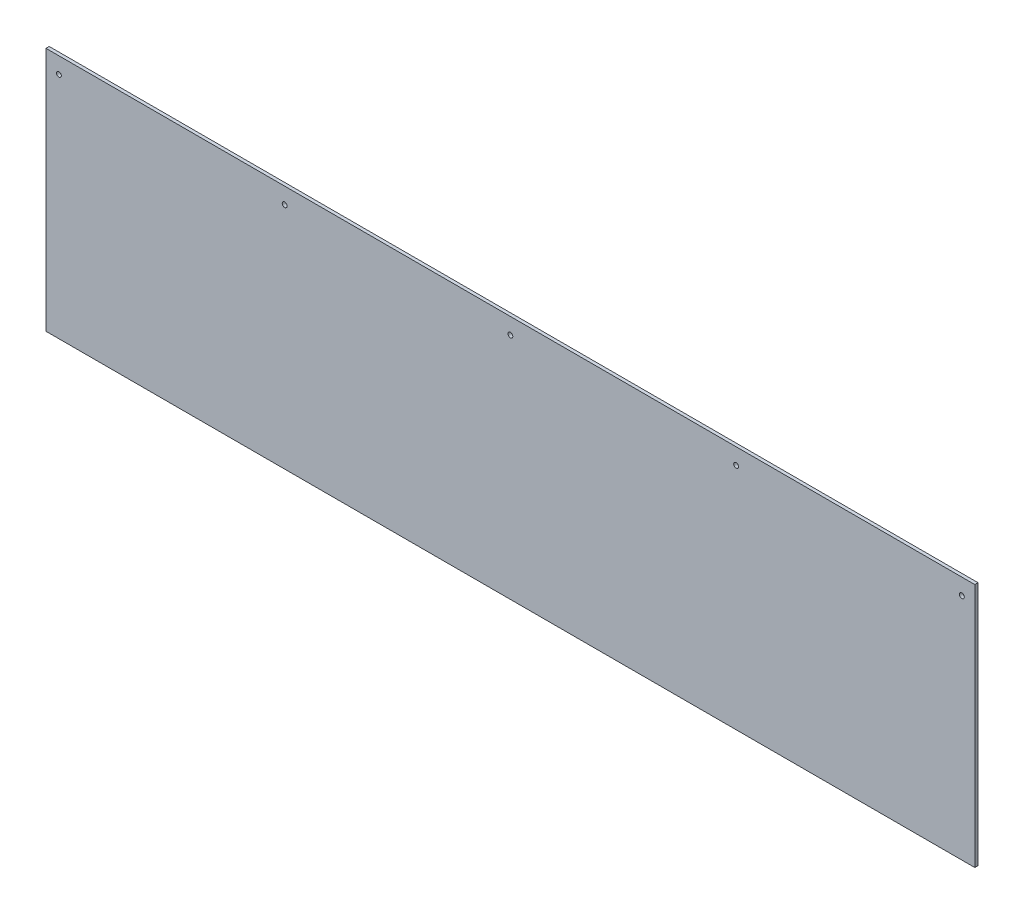
ISO-10303-21;
HEADER;
FILE_DESCRIPTION(('STEP AP214'),'2;1');
FILE_NAME('part.step','',(''),(''),'','','');
FILE_SCHEMA(('AUTOMOTIVE_DESIGN { 1 0 10303 214 1 1 1 1 }'));
ENDSEC;
DATA;
#1=APPLICATION_CONTEXT('core data for automotive mechanical design processes');
#2=APPLICATION_PROTOCOL_DEFINITION('international standard','automotive_design',2000,#1);
#3=PRODUCT_CONTEXT('',#1,'mechanical');
#4=PRODUCT('Part','Part','',(#3));
#5=PRODUCT_RELATED_PRODUCT_CATEGORY('part','',(#4));
#6=PRODUCT_DEFINITION_FORMATION('','',#4);
#7=PRODUCT_DEFINITION_CONTEXT('part definition',#1,'design');
#8=PRODUCT_DEFINITION('design','',#6,#7);
#9=PRODUCT_DEFINITION_SHAPE('','',#8);
#10=(LENGTH_UNIT() NAMED_UNIT(*) SI_UNIT(.MILLI.,.METRE.));
#11=(NAMED_UNIT(*) PLANE_ANGLE_UNIT() SI_UNIT($,.RADIAN.));
#12=(NAMED_UNIT(*) SI_UNIT($,.STERADIAN.) SOLID_ANGLE_UNIT());
#13=UNCERTAINTY_MEASURE_WITH_UNIT(LENGTH_MEASURE(1.E-05),#10,'distance_accuracy_value','');
#14=(GEOMETRIC_REPRESENTATION_CONTEXT(3) GLOBAL_UNCERTAINTY_ASSIGNED_CONTEXT((#13)) GLOBAL_UNIT_ASSIGNED_CONTEXT((#10,
#11,#12)) REPRESENTATION_CONTEXT('',''));
#15=CARTESIAN_POINT('',(0.,0.,0.));
#16=DIRECTION('',(0.,0.,1.));
#17=DIRECTION('',(1.,0.,0.));
#18=AXIS2_PLACEMENT_3D('',#15,#16,#17);
#19=CARTESIAN_POINT('',(869.713093645015,241.584629983021,6.35));
#20=DIRECTION('',(0.,0.,1.));
#21=DIRECTION('',(1.,0.,0.));
#22=AXIS2_PLACEMENT_3D('',#19,#20,#21);
#23=PLANE('',#22);
#24=CARTESIAN_POINT('',(1758.71309364502,451.13462998302,6.35));
#25=DIRECTION('',(0.,0.,1.));
#26=DIRECTION('',(1.,0.,0.));
#27=AXIS2_PLACEMENT_3D('',#24,#25,#26);
#28=CIRCLE('',#27,4.7625);
#29=CARTESIAN_POINT('',(1763.47559364502,451.13462998302,6.35));
#30=VERTEX_POINT('',#29);
#31=EDGE_CURVE('E95',#30,#30,#28,.F.);
#32=ORIENTED_EDGE('',*,*,#31,.T.);
#33=EDGE_LOOP('',(#32));
#34=FACE_BOUND('',#33,.T.);
#35=CARTESIAN_POINT('',(1314.21309364502,451.13462998302,6.35));
#36=DIRECTION('',(0.,0.,1.));
#37=DIRECTION('',(1.,0.,0.));
#38=AXIS2_PLACEMENT_3D('',#35,#36,#37);
#39=CIRCLE('',#38,4.7625);
#40=CARTESIAN_POINT('',(1318.97559364502,451.13462998302,6.35));
#41=VERTEX_POINT('',#40);
#42=EDGE_CURVE('E98',#41,#41,#39,.F.);
#43=ORIENTED_EDGE('',*,*,#42,.T.);
#44=EDGE_LOOP('',(#43));
#45=FACE_BOUND('',#44,.T.);
#46=CARTESIAN_POINT('',(869.713093645015,451.13462998302,6.35));
#47=DIRECTION('',(0.,0.,1.));
#48=DIRECTION('',(1.,0.,0.));
#49=AXIS2_PLACEMENT_3D('',#46,#47,#48);
#50=CIRCLE('',#49,4.7625);
#51=CARTESIAN_POINT('',(874.475593645015,451.13462998302,6.35));
#52=VERTEX_POINT('',#51);
#53=EDGE_CURVE('E101',#52,#52,#50,.F.);
#54=ORIENTED_EDGE('',*,*,#53,.T.);
#55=EDGE_LOOP('',(#54));
#56=FACE_BOUND('',#55,.T.);
#57=CARTESIAN_POINT('',(425.213093645015,451.13462998302,6.35));
#58=DIRECTION('',(0.,0.,1.));
#59=DIRECTION('',(1.,0.,0.));
#60=AXIS2_PLACEMENT_3D('',#57,#58,#59);
#61=CIRCLE('',#60,4.7625);
#62=CARTESIAN_POINT('',(429.975593645015,451.13462998302,6.35));
#63=VERTEX_POINT('',#62);
#64=EDGE_CURVE('E103',#63,#63,#61,.F.);
#65=ORIENTED_EDGE('',*,*,#64,.T.);
#66=EDGE_LOOP('',(#65));
#67=FACE_BOUND('',#66,.T.);
#68=CARTESIAN_POINT('',(-19.2869063549861,451.13462998302,6.35));
#69=DIRECTION('',(0.,0.,1.));
#70=DIRECTION('',(1.,0.,0.));
#71=AXIS2_PLACEMENT_3D('',#68,#69,#70);
#72=CIRCLE('',#71,4.7625);
#73=CARTESIAN_POINT('',(-14.5244063549861,451.13462998302,6.35));
#74=VERTEX_POINT('',#73);
#75=EDGE_CURVE('E20',#74,#74,#72,.F.);
#76=ORIENTED_EDGE('',*,*,#75,.T.);
#77=EDGE_LOOP('',(#76));
#78=FACE_BOUND('',#77,.T.);
#79=DIRECTION('',(0.,1.,0.));
#80=VECTOR('',#79,1.);
#81=CARTESIAN_POINT('',(-44.6869063549859,0.284629983020582,6.35));
#82=LINE('',#81,#80);
#83=CARTESIAN_POINT('',(-44.6869063549859,0.284629983020591,6.35));
#84=VERTEX_POINT('',#83);
#85=CARTESIAN_POINT('',(-44.6869063549859,482.88462998302,6.35));
#86=VERTEX_POINT('',#85);
#87=EDGE_CURVE('E71',#84,#86,#82,.T.);
#88=ORIENTED_EDGE('',*,*,#87,.F.);
#89=DIRECTION('',(1.,0.,0.));
#90=VECTOR('',#89,1.);
#91=CARTESIAN_POINT('',(1784.11309364501,0.284629983020582,6.35));
#92=LINE('',#91,#90);
#93=CARTESIAN_POINT('',(1784.11309364501,0.28462998302063,6.35));
#94=VERTEX_POINT('',#93);
#95=EDGE_CURVE('E68',#94,#84,#92,.F.);
#96=ORIENTED_EDGE('',*,*,#95,.F.);
#97=DIRECTION('',(0.,1.,0.));
#98=VECTOR('',#97,1.);
#99=CARTESIAN_POINT('',(1784.11309364501,482.88462998302,6.35));
#100=LINE('',#99,#98);
#101=CARTESIAN_POINT('',(1784.11309364501,482.88462998302,6.35));
#102=VERTEX_POINT('',#101);
#103=EDGE_CURVE('E59',#102,#94,#100,.F.);
#104=ORIENTED_EDGE('',*,*,#103,.F.);
#105=DIRECTION('',(1.,0.,0.));
#106=VECTOR('',#105,1.);
#107=CARTESIAN_POINT('',(-44.6869063549862,482.88462998302,6.35));
#108=LINE('',#107,#106);
#109=EDGE_CURVE('E54',#86,#102,#108,.T.);
#110=ORIENTED_EDGE('',*,*,#109,.F.);
#111=EDGE_LOOP('',(#88,#96,#104,#110));
#112=FACE_BOUND('',#111,.T.);
#113=ADVANCED_FACE('F17',(#34,#45,#56,#67,#78,#112),#23,.T.);
#114=CARTESIAN_POINT('',(1784.11309364501,0.284629983020582,0.));
#115=DIRECTION('',(0.,-1.,0.));
#116=DIRECTION('',(0.,0.,-1.));
#117=AXIS2_PLACEMENT_3D('',#114,#115,#116);
#118=PLANE('',#117);
#119=ORIENTED_EDGE('',*,*,#95,.T.);
#120=DIRECTION('',(0.,0.,1.));
#121=VECTOR('',#120,1.);
#122=CARTESIAN_POINT('',(-44.6869063549859,0.284629983020584,0.));
#123=LINE('',#122,#121);
#124=CARTESIAN_POINT('',(-44.6869063549859,0.284629983020585,0.));
#125=VERTEX_POINT('',#124);
#126=EDGE_CURVE('E111',#125,#84,#123,.T.);
#127=ORIENTED_EDGE('',*,*,#126,.F.);
#128=DIRECTION('',(1.,0.,0.));
#129=VECTOR('',#128,1.);
#130=CARTESIAN_POINT('',(869.713093645015,0.28462998302059,0.));
#131=LINE('',#130,#129);
#132=CARTESIAN_POINT('',(1784.11309364501,0.284629983020614,0.));
#133=VERTEX_POINT('',#132);
#134=EDGE_CURVE('E78',#125,#133,#131,.T.);
#135=ORIENTED_EDGE('',*,*,#134,.T.);
#136=DIRECTION('',(0.,0.,-1.));
#137=VECTOR('',#136,1.);
#138=CARTESIAN_POINT('',(1784.11309364501,0.284629983020701,0.));
#139=LINE('',#138,#137);
#140=EDGE_CURVE('E64',#94,#133,#139,.T.);
#141=ORIENTED_EDGE('',*,*,#140,.F.);
#142=EDGE_LOOP('',(#119,#127,#135,#141));
#143=FACE_BOUND('',#142,.T.);
#144=ADVANCED_FACE('F77',(#143),#118,.T.);
#145=CARTESIAN_POINT('',(1784.11309364501,482.88462998302,0.));
#146=DIRECTION('',(1.,0.,0.));
#147=DIRECTION('',(0.,0.,-1.));
#148=AXIS2_PLACEMENT_3D('',#145,#146,#147);
#149=PLANE('',#148);
#150=ORIENTED_EDGE('',*,*,#103,.T.);
#151=ORIENTED_EDGE('',*,*,#140,.T.);
#152=DIRECTION('',(0.,1.,0.));
#153=VECTOR('',#152,1.);
#154=CARTESIAN_POINT('',(1784.11309364501,241.584629983021,0.));
#155=LINE('',#154,#153);
#156=CARTESIAN_POINT('',(1784.11309364501,482.88462998302,0.));
#157=VERTEX_POINT('',#156);
#158=EDGE_CURVE('E122',#133,#157,#155,.T.);
#159=ORIENTED_EDGE('',*,*,#158,.T.);
#160=DIRECTION('',(0.,0.,1.));
#161=VECTOR('',#160,1.);
#162=CARTESIAN_POINT('',(1784.11309364501,482.88462998302,0.));
#163=LINE('',#162,#161);
#164=EDGE_CURVE('E66',#102,#157,#163,.F.);
#165=ORIENTED_EDGE('',*,*,#164,.F.);
#166=EDGE_LOOP('',(#150,#151,#159,#165));
#167=FACE_BOUND('',#166,.T.);
#168=ADVANCED_FACE('F61',(#167),#149,.T.);
#169=CARTESIAN_POINT('',(-44.6869063549862,482.88462998302,0.));
#170=DIRECTION('',(0.,1.,0.));
#171=DIRECTION('',(0.,0.,1.));
#172=AXIS2_PLACEMENT_3D('',#169,#170,#171);
#173=PLANE('',#172);
#174=ORIENTED_EDGE('',*,*,#109,.T.);
#175=ORIENTED_EDGE('',*,*,#164,.T.);
#176=DIRECTION('',(1.,0.,0.));
#177=VECTOR('',#176,1.);
#178=CARTESIAN_POINT('',(869.713093645015,482.88462998302,0.));
#179=LINE('',#178,#177);
#180=CARTESIAN_POINT('',(-44.6869063549859,482.88462998302,0.));
#181=VERTEX_POINT('',#180);
#182=EDGE_CURVE('E119',#157,#181,#179,.F.);
#183=ORIENTED_EDGE('',*,*,#182,.T.);
#184=DIRECTION('',(0.,0.,1.));
#185=VECTOR('',#184,1.);
#186=CARTESIAN_POINT('',(-44.6869063549859,482.88462998302,0.));
#187=LINE('',#186,#185);
#188=EDGE_CURVE('E35',#86,#181,#187,.F.);
#189=ORIENTED_EDGE('',*,*,#188,.F.);
#190=EDGE_LOOP('',(#174,#175,#183,#189));
#191=FACE_BOUND('',#190,.T.);
#192=ADVANCED_FACE('F118',(#191),#173,.T.);
#193=CARTESIAN_POINT('',(-44.6869063549859,0.284629983020582,0.));
#194=DIRECTION('',(-1.,0.,0.));
#195=DIRECTION('',(0.,0.,1.));
#196=AXIS2_PLACEMENT_3D('',#193,#194,#195);
#197=PLANE('',#196);
#198=ORIENTED_EDGE('',*,*,#87,.T.);
#199=ORIENTED_EDGE('',*,*,#188,.T.);
#200=DIRECTION('',(0.,1.,0.));
#201=VECTOR('',#200,1.);
#202=CARTESIAN_POINT('',(-44.686906354986,241.584629983021,0.));
#203=LINE('',#202,#201);
#204=EDGE_CURVE('E94',#181,#125,#203,.F.);
#205=ORIENTED_EDGE('',*,*,#204,.T.);
#206=ORIENTED_EDGE('',*,*,#126,.T.);
#207=EDGE_LOOP('',(#198,#199,#205,#206));
#208=FACE_BOUND('',#207,.T.);
#209=ADVANCED_FACE('F125',(#208),#197,.T.);
#210=CARTESIAN_POINT('',(-19.2869063549861,451.13462998302,0.));
#211=DIRECTION('',(0.,0.,1.));
#212=DIRECTION('',(1.,0.,0.));
#213=AXIS2_PLACEMENT_3D('',#210,#211,#212);
#214=CYLINDRICAL_SURFACE('',#213,4.7625);
#215=ORIENTED_EDGE('',*,*,#75,.F.);
#216=EDGE_LOOP('',(#215));
#217=FACE_BOUND('',#216,.T.);
#218=CARTESIAN_POINT('',(-19.2869063549861,451.13462998302,0.));
#219=DIRECTION('',(0.,0.,1.));
#220=DIRECTION('',(1.,0.,0.));
#221=AXIS2_PLACEMENT_3D('',#218,#219,#220);
#222=CIRCLE('',#221,4.7625);
#223=CARTESIAN_POINT('',(-14.5244063549861,451.13462998302,0.));
#224=VERTEX_POINT('',#223);
#225=EDGE_CURVE('E91',#224,#224,#222,.F.);
#226=ORIENTED_EDGE('',*,*,#225,.T.);
#227=EDGE_LOOP('',(#226));
#228=FACE_BOUND('',#227,.T.);
#229=ADVANCED_FACE('F127',(#217,#228),#214,.F.);
#230=CARTESIAN_POINT('',(425.213093645015,451.13462998302,0.));
#231=DIRECTION('',(0.,0.,1.));
#232=DIRECTION('',(1.,0.,0.));
#233=AXIS2_PLACEMENT_3D('',#230,#231,#232);
#234=CYLINDRICAL_SURFACE('',#233,4.7625);
#235=ORIENTED_EDGE('',*,*,#64,.F.);
#236=EDGE_LOOP('',(#235));
#237=FACE_BOUND('',#236,.T.);
#238=CARTESIAN_POINT('',(425.213093645015,451.13462998302,0.));
#239=DIRECTION('',(0.,0.,1.));
#240=DIRECTION('',(1.,0.,0.));
#241=AXIS2_PLACEMENT_3D('',#238,#239,#240);
#242=CIRCLE('',#241,4.7625);
#243=CARTESIAN_POINT('',(429.975593645015,451.13462998302,0.));
#244=VERTEX_POINT('',#243);
#245=EDGE_CURVE('E88',#244,#244,#242,.F.);
#246=ORIENTED_EDGE('',*,*,#245,.T.);
#247=EDGE_LOOP('',(#246));
#248=FACE_BOUND('',#247,.T.);
#249=ADVANCED_FACE('F134',(#237,#248),#234,.F.);
#250=CARTESIAN_POINT('',(869.713093645015,451.13462998302,0.));
#251=DIRECTION('',(0.,0.,1.));
#252=DIRECTION('',(1.,0.,0.));
#253=AXIS2_PLACEMENT_3D('',#250,#251,#252);
#254=CYLINDRICAL_SURFACE('',#253,4.7625);
#255=ORIENTED_EDGE('',*,*,#53,.F.);
#256=EDGE_LOOP('',(#255));
#257=FACE_BOUND('',#256,.T.);
#258=CARTESIAN_POINT('',(869.713093645015,451.13462998302,0.));
#259=DIRECTION('',(0.,0.,1.));
#260=DIRECTION('',(1.,0.,0.));
#261=AXIS2_PLACEMENT_3D('',#258,#259,#260);
#262=CIRCLE('',#261,4.7625);
#263=CARTESIAN_POINT('',(874.475593645015,451.13462998302,0.));
#264=VERTEX_POINT('',#263);
#265=EDGE_CURVE('E85',#264,#264,#262,.F.);
#266=ORIENTED_EDGE('',*,*,#265,.T.);
#267=EDGE_LOOP('',(#266));
#268=FACE_BOUND('',#267,.T.);
#269=ADVANCED_FACE('F153',(#257,#268),#254,.F.);
#270=CARTESIAN_POINT('',(1314.21309364502,451.13462998302,0.));
#271=DIRECTION('',(0.,0.,1.));
#272=DIRECTION('',(1.,0.,0.));
#273=AXIS2_PLACEMENT_3D('',#270,#271,#272);
#274=CYLINDRICAL_SURFACE('',#273,4.7625);
#275=ORIENTED_EDGE('',*,*,#42,.F.);
#276=EDGE_LOOP('',(#275));
#277=FACE_BOUND('',#276,.T.);
#278=CARTESIAN_POINT('',(1314.21309364502,451.13462998302,0.));
#279=DIRECTION('',(0.,0.,1.));
#280=DIRECTION('',(1.,0.,0.));
#281=AXIS2_PLACEMENT_3D('',#278,#279,#280);
#282=CIRCLE('',#281,4.7625);
#283=CARTESIAN_POINT('',(1318.97559364502,451.13462998302,0.));
#284=VERTEX_POINT('',#283);
#285=EDGE_CURVE('E26',#284,#284,#282,.F.);
#286=ORIENTED_EDGE('',*,*,#285,.T.);
#287=EDGE_LOOP('',(#286));
#288=FACE_BOUND('',#287,.T.);
#289=ADVANCED_FACE('F145',(#277,#288),#274,.F.);
#290=CARTESIAN_POINT('',(1758.71309364502,451.13462998302,0.));
#291=DIRECTION('',(0.,0.,1.));
#292=DIRECTION('',(1.,0.,0.));
#293=AXIS2_PLACEMENT_3D('',#290,#291,#292);
#294=CYLINDRICAL_SURFACE('',#293,4.7625);
#295=ORIENTED_EDGE('',*,*,#31,.F.);
#296=EDGE_LOOP('',(#295));
#297=FACE_BOUND('',#296,.T.);
#298=CARTESIAN_POINT('',(1758.71309364502,451.13462998302,0.));
#299=DIRECTION('',(0.,0.,1.));
#300=DIRECTION('',(1.,0.,0.));
#301=AXIS2_PLACEMENT_3D('',#298,#299,#300);
#302=CIRCLE('',#301,4.7625);
#303=CARTESIAN_POINT('',(1763.47559364502,451.13462998302,0.));
#304=VERTEX_POINT('',#303);
#305=EDGE_CURVE('E11',#304,#304,#302,.F.);
#306=ORIENTED_EDGE('',*,*,#305,.T.);
#307=EDGE_LOOP('',(#306));
#308=FACE_BOUND('',#307,.T.);
#309=ADVANCED_FACE('F139',(#297,#308),#294,.F.);
#310=CARTESIAN_POINT('',(869.713093645015,241.584629983021,0.));
#311=DIRECTION('',(0.,0.,1.));
#312=DIRECTION('',(1.,0.,0.));
#313=AXIS2_PLACEMENT_3D('',#310,#311,#312);
#314=PLANE('',#313);
#315=ORIENTED_EDGE('',*,*,#305,.F.);
#316=EDGE_LOOP('',(#315));
#317=FACE_BOUND('',#316,.T.);
#318=ORIENTED_EDGE('',*,*,#285,.F.);
#319=EDGE_LOOP('',(#318));
#320=FACE_BOUND('',#319,.T.);
#321=ORIENTED_EDGE('',*,*,#265,.F.);
#322=EDGE_LOOP('',(#321));
#323=FACE_BOUND('',#322,.T.);
#324=ORIENTED_EDGE('',*,*,#245,.F.);
#325=EDGE_LOOP('',(#324));
#326=FACE_BOUND('',#325,.T.);
#327=ORIENTED_EDGE('',*,*,#225,.F.);
#328=EDGE_LOOP('',(#327));
#329=FACE_BOUND('',#328,.T.);
#330=ORIENTED_EDGE('',*,*,#182,.F.);
#331=ORIENTED_EDGE('',*,*,#158,.F.);
#332=ORIENTED_EDGE('',*,*,#134,.F.);
#333=ORIENTED_EDGE('',*,*,#204,.F.);
#334=EDGE_LOOP('',(#330,#331,#332,#333));
#335=FACE_BOUND('',#334,.T.);
#336=ADVANCED_FACE('F121',(#317,#320,#323,#326,#329,#335),#314,.F.);
#337=CLOSED_SHELL('',(#113,#144,#168,#192,#209,#229,#249,#269,#289,#309,#336));
#338=MANIFOLD_SOLID_BREP('B1',#337);
#339=ADVANCED_BREP_SHAPE_REPRESENTATION('',(#18,#338),#14);
#340=SHAPE_DEFINITION_REPRESENTATION(#9,#339);
ENDSEC;
END-ISO-10303-21;
